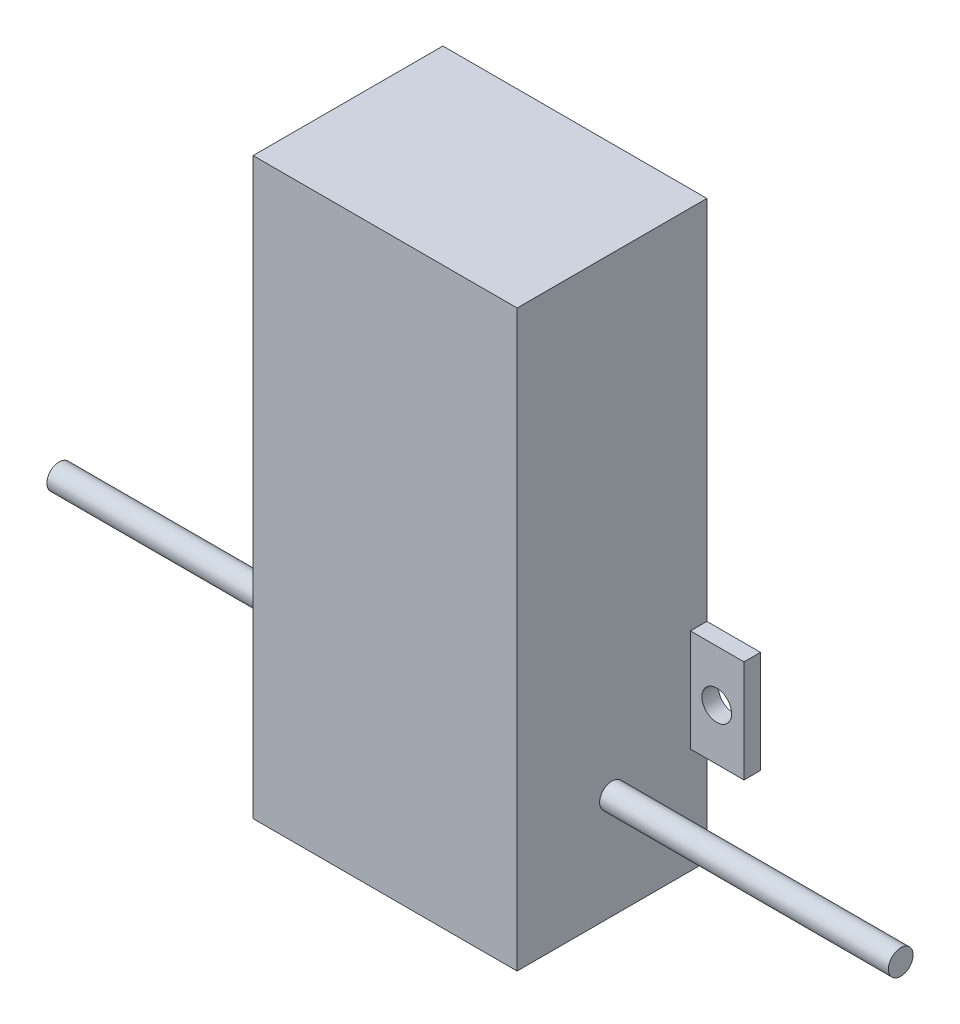
ISO-10303-21;
HEADER;
FILE_DESCRIPTION(('STEP AP214'),'2;1');
FILE_NAME('part.step','',(''),(''),'','','');
FILE_SCHEMA(('AUTOMOTIVE_DESIGN { 1 0 10303 214 1 1 1 1 }'));
ENDSEC;
DATA;
#1=APPLICATION_CONTEXT('core data for automotive mechanical design processes');
#2=APPLICATION_PROTOCOL_DEFINITION('international standard','automotive_design',2000,#1);
#3=PRODUCT_CONTEXT('',#1,'mechanical');
#4=PRODUCT('Part','Part','',(#3));
#5=PRODUCT_RELATED_PRODUCT_CATEGORY('part','',(#4));
#6=PRODUCT_DEFINITION_FORMATION('','',#4);
#7=PRODUCT_DEFINITION_CONTEXT('part definition',#1,'design');
#8=PRODUCT_DEFINITION('design','',#6,#7);
#9=PRODUCT_DEFINITION_SHAPE('','',#8);
#10=(LENGTH_UNIT() NAMED_UNIT(*) SI_UNIT(.MILLI.,.METRE.));
#11=(NAMED_UNIT(*) PLANE_ANGLE_UNIT() SI_UNIT($,.RADIAN.));
#12=(NAMED_UNIT(*) SI_UNIT($,.STERADIAN.) SOLID_ANGLE_UNIT());
#13=UNCERTAINTY_MEASURE_WITH_UNIT(LENGTH_MEASURE(1.E-05),#10,'distance_accuracy_value','');
#14=(GEOMETRIC_REPRESENTATION_CONTEXT(3) GLOBAL_UNCERTAINTY_ASSIGNED_CONTEXT((#13)) GLOBAL_UNIT_ASSIGNED_CONTEXT((#10,
#11,#12)) REPRESENTATION_CONTEXT('',''));
#15=CARTESIAN_POINT('',(0.,0.,0.));
#16=DIRECTION('',(0.,0.,1.));
#17=DIRECTION('',(1.,0.,0.));
#18=AXIS2_PLACEMENT_3D('',#15,#16,#17);
#19=CARTESIAN_POINT('',(34.2790620031797,29.2729411764706,23.));
#20=DIRECTION('',(-1.,0.,0.));
#21=DIRECTION('',(0.,0.,1.));
#22=AXIS2_PLACEMENT_3D('',#19,#20,#21);
#23=PLANE('',#22);
#24=CARTESIAN_POINT('',(34.2790620031797,-27.6270588235294,11.5));
#25=DIRECTION('',(-1.,0.,0.));
#26=DIRECTION('',(0.,0.,1.));
#27=AXIS2_PLACEMENT_3D('',#24,#25,#26);
#28=CIRCLE('',#27,1.5);
#29=CARTESIAN_POINT('',(34.2790620031797,-27.6270588235294,13.));
#30=VERTEX_POINT('',#29);
#31=EDGE_CURVE('E44',#30,#30,#28,.T.);
#32=ORIENTED_EDGE('',*,*,#31,.F.);
#33=EDGE_LOOP('',(#32));
#34=FACE_BOUND('',#33,.T.);
#35=DIRECTION('',(0.,-1.,0.));
#36=VECTOR('',#35,1.);
#37=CARTESIAN_POINT('',(34.2790620031797,-19.5220896505135,2.));
#38=LINE('',#37,#36);
#39=CARTESIAN_POINT('',(34.2790620031797,-15.1220896505135,2.));
#40=VERTEX_POINT('',#39);
#41=CARTESIAN_POINT('',(34.2790620031797,-28.4172027618297,2.));
#42=VERTEX_POINT('',#41);
#43=EDGE_CURVE('E154',#40,#42,#38,.T.);
#44=ORIENTED_EDGE('',*,*,#43,.T.);
#45=DIRECTION('',(0.,0.,1.));
#46=VECTOR('',#45,1.);
#47=CARTESIAN_POINT('',(34.2790620031797,-28.4172027618297,23.));
#48=LINE('',#47,#46);
#49=CARTESIAN_POINT('',(34.2790620031797,-28.4172027618297,0.));
#50=VERTEX_POINT('',#49);
#51=EDGE_CURVE('E11',#50,#42,#48,.T.);
#52=ORIENTED_EDGE('',*,*,#51,.F.);
#53=DIRECTION('',(0.,1.,0.));
#54=VECTOR('',#53,1.);
#55=CARTESIAN_POINT('',(34.2790620031797,29.2729411764706,0.));
#56=LINE('',#55,#54);
#57=CARTESIAN_POINT('',(34.2790620031797,-40.3270588235294,0.));
#58=VERTEX_POINT('',#57);
#59=EDGE_CURVE('E140',#58,#50,#56,.T.);
#60=ORIENTED_EDGE('',*,*,#59,.F.);
#61=DIRECTION('',(0.,0.,-1.));
#62=VECTOR('',#61,1.);
#63=CARTESIAN_POINT('',(34.2790620031797,-40.3270588235294,23.));
#64=LINE('',#63,#62);
#65=CARTESIAN_POINT('',(34.2790620031797,-40.3270588235294,23.));
#66=VERTEX_POINT('',#65);
#67=EDGE_CURVE('E171',#66,#58,#64,.T.);
#68=ORIENTED_EDGE('',*,*,#67,.F.);
#69=DIRECTION('',(0.,1.,0.));
#70=VECTOR('',#69,1.);
#71=CARTESIAN_POINT('',(34.2790620031797,29.2729411764706,23.));
#72=LINE('',#71,#70);
#73=CARTESIAN_POINT('',(34.2790620031797,29.2729411764706,23.));
#74=VERTEX_POINT('',#73);
#75=EDGE_CURVE('E168',#66,#74,#72,.T.);
#76=ORIENTED_EDGE('',*,*,#75,.T.);
#77=DIRECTION('',(0.,0.,-1.));
#78=VECTOR('',#77,1.);
#79=CARTESIAN_POINT('',(34.2790620031797,29.2729411764706,23.));
#80=LINE('',#79,#78);
#81=CARTESIAN_POINT('',(34.2790620031797,29.2729411764706,0.));
#82=VERTEX_POINT('',#81);
#83=EDGE_CURVE('E175',#74,#82,#80,.T.);
#84=ORIENTED_EDGE('',*,*,#83,.T.);
#85=CARTESIAN_POINT('',(34.2790620031797,-15.1220896505135,0.));
#86=VERTEX_POINT('',#85);
#87=EDGE_CURVE('E167',#86,#82,#56,.T.);
#88=ORIENTED_EDGE('',*,*,#87,.F.);
#89=DIRECTION('',(0.,0.,1.));
#90=VECTOR('',#89,1.);
#91=CARTESIAN_POINT('',(34.2790620031797,-15.1220896505135,0.));
#92=LINE('',#91,#90);
#93=EDGE_CURVE('E55',#86,#40,#92,.T.);
#94=ORIENTED_EDGE('',*,*,#93,.T.);
#95=EDGE_LOOP('',(#44,#52,#60,#68,#76,#84,#88,#94));
#96=FACE_BOUND('',#95,.T.);
#97=ADVANCED_FACE('F36',(#34,#96),#23,.T.);
#98=CARTESIAN_POINT('',(66.2790620031797,29.2729411764706,23.));
#99=DIRECTION('',(-1.,0.,0.));
#100=DIRECTION('',(0.,0.,1.));
#101=AXIS2_PLACEMENT_3D('',#98,#99,#100);
#102=PLANE('',#101);
#103=CARTESIAN_POINT('',(66.2790620031797,-27.6270588235294,11.5));
#104=DIRECTION('',(-1.,0.,0.));
#105=DIRECTION('',(0.,0.,1.));
#106=AXIS2_PLACEMENT_3D('',#103,#104,#105);
#107=CIRCLE('',#106,1.5);
#108=CARTESIAN_POINT('',(66.2790620031797,-27.6270588235294,13.));
#109=VERTEX_POINT('',#108);
#110=EDGE_CURVE('E229',#109,#109,#107,.F.);
#111=ORIENTED_EDGE('',*,*,#110,.F.);
#112=EDGE_LOOP('',(#111));
#113=FACE_BOUND('',#112,.T.);
#114=DIRECTION('',(0.,0.,1.));
#115=VECTOR('',#114,1.);
#116=CARTESIAN_POINT('',(66.2790620031797,-27.5220896505135,0.));
#117=LINE('',#116,#115);
#118=CARTESIAN_POINT('',(66.2790620031797,-27.5220896505135,0.));
#119=VERTEX_POINT('',#118);
#120=CARTESIAN_POINT('',(66.2790620031797,-27.5220896505135,2.));
#121=VERTEX_POINT('',#120);
#122=EDGE_CURVE('E178',#119,#121,#117,.T.);
#123=ORIENTED_EDGE('',*,*,#122,.T.);
#124=DIRECTION('',(0.,-1.,0.));
#125=VECTOR('',#124,1.);
#126=CARTESIAN_POINT('',(66.2790620031797,-19.5220896505135,2.));
#127=LINE('',#126,#125);
#128=CARTESIAN_POINT('',(66.2790620031797,-15.1220896505135,2.));
#129=VERTEX_POINT('',#128);
#130=EDGE_CURVE('E195',#129,#121,#127,.T.);
#131=ORIENTED_EDGE('',*,*,#130,.F.);
#132=DIRECTION('',(0.,0.,1.));
#133=VECTOR('',#132,1.);
#134=CARTESIAN_POINT('',(66.2790620031797,-15.1220896505135,0.));
#135=LINE('',#134,#133);
#136=CARTESIAN_POINT('',(66.2790620031797,-15.1220896505135,0.));
#137=VERTEX_POINT('',#136);
#138=EDGE_CURVE('E190',#137,#129,#135,.T.);
#139=ORIENTED_EDGE('',*,*,#138,.F.);
#140=DIRECTION('',(0.,1.,0.));
#141=VECTOR('',#140,1.);
#142=CARTESIAN_POINT('',(66.2790620031797,29.2729411764706,0.));
#143=LINE('',#142,#141);
#144=CARTESIAN_POINT('',(66.2790620031797,29.2729411764706,0.));
#145=VERTEX_POINT('',#144);
#146=EDGE_CURVE('E219',#137,#145,#143,.T.);
#147=ORIENTED_EDGE('',*,*,#146,.T.);
#148=DIRECTION('',(0.,0.,-1.));
#149=VECTOR('',#148,1.);
#150=CARTESIAN_POINT('',(66.2790620031797,29.2729411764706,23.));
#151=LINE('',#150,#149);
#152=CARTESIAN_POINT('',(66.2790620031797,29.2729411764706,23.));
#153=VERTEX_POINT('',#152);
#154=EDGE_CURVE('E217',#153,#145,#151,.T.);
#155=ORIENTED_EDGE('',*,*,#154,.F.);
#156=DIRECTION('',(0.,1.,0.));
#157=VECTOR('',#156,1.);
#158=CARTESIAN_POINT('',(66.2790620031797,29.2729411764706,23.));
#159=LINE('',#158,#157);
#160=CARTESIAN_POINT('',(66.2790620031797,-40.3270588235294,23.));
#161=VERTEX_POINT('',#160);
#162=EDGE_CURVE('E212',#161,#153,#159,.T.);
#163=ORIENTED_EDGE('',*,*,#162,.F.);
#164=DIRECTION('',(0.,0.,-1.));
#165=VECTOR('',#164,1.);
#166=CARTESIAN_POINT('',(66.2790620031797,-40.3270588235294,23.));
#167=LINE('',#166,#165);
#168=CARTESIAN_POINT('',(66.2790620031797,-40.3270588235294,0.));
#169=VERTEX_POINT('',#168);
#170=EDGE_CURVE('E226',#161,#169,#167,.T.);
#171=ORIENTED_EDGE('',*,*,#170,.T.);
#172=EDGE_CURVE('E220',#169,#119,#143,.T.);
#173=ORIENTED_EDGE('',*,*,#172,.T.);
#174=EDGE_LOOP('',(#123,#131,#139,#147,#155,#163,#171,#173));
#175=FACE_BOUND('',#174,.T.);
#176=ADVANCED_FACE('F237',(#113,#175),#102,.F.);
#177=CARTESIAN_POINT('',(0.,0.,0.));
#178=DIRECTION('',(0.,0.,1.));
#179=DIRECTION('',(1.,0.,0.));
#180=AXIS2_PLACEMENT_3D('',#177,#178,#179);
#181=PLANE('',#180);
#182=CARTESIAN_POINT('',(31.0771714081852,-21.7720896505135,0.));
#183=DIRECTION('',(0.,0.,1.));
#184=DIRECTION('',(1.,0.,0.));
#185=AXIS2_PLACEMENT_3D('',#182,#183,#184);
#186=CIRCLE('',#185,1.79810940500553);
#187=CARTESIAN_POINT('',(32.8752808131908,-21.7720896505135,0.));
#188=VERTEX_POINT('',#187);
#189=EDGE_CURVE('E339',#188,#188,#186,.T.);
#190=ORIENTED_EDGE('',*,*,#189,.T.);
#191=EDGE_LOOP('',(#190));
#192=FACE_BOUND('',#191,.T.);
#193=ORIENTED_EDGE('',*,*,#59,.T.);
#194=DIRECTION('',(-1.,0.,0.));
#195=VECTOR('',#194,1.);
#196=CARTESIAN_POINT('',(35.2790620031797,-28.4172027618297,0.));
#197=LINE('',#196,#195);
#198=CARTESIAN_POINT('',(27.7790620031797,-28.4172027618297,0.));
#199=VERTEX_POINT('',#198);
#200=EDGE_CURVE('E137',#50,#199,#197,.T.);
#201=ORIENTED_EDGE('',*,*,#200,.T.);
#202=DIRECTION('',(0.,1.,0.));
#203=VECTOR('',#202,1.);
#204=CARTESIAN_POINT('',(27.7790620031797,-19.5220896505135,0.));
#205=LINE('',#204,#203);
#206=CARTESIAN_POINT('',(27.7790620031797,-15.1220896505135,0.));
#207=VERTEX_POINT('',#206);
#208=EDGE_CURVE('E124',#199,#207,#205,.T.);
#209=ORIENTED_EDGE('',*,*,#208,.T.);
#210=DIRECTION('',(1.,0.,0.));
#211=VECTOR('',#210,1.);
#212=CARTESIAN_POINT('',(27.7790620031797,-15.1220896505135,0.));
#213=LINE('',#212,#211);
#214=EDGE_CURVE('E158',#207,#86,#213,.T.);
#215=ORIENTED_EDGE('',*,*,#214,.T.);
#216=ORIENTED_EDGE('',*,*,#87,.T.);
#217=DIRECTION('',(-1.,0.,0.));
#218=VECTOR('',#217,1.);
#219=CARTESIAN_POINT('',(34.2790620031797,29.2729411764706,0.));
#220=LINE('',#219,#218);
#221=EDGE_CURVE('E213',#145,#82,#220,.T.);
#222=ORIENTED_EDGE('',*,*,#221,.F.);
#223=ORIENTED_EDGE('',*,*,#146,.F.);
#224=DIRECTION('',(-1.,0.,0.));
#225=VECTOR('',#224,1.);
#226=CARTESIAN_POINT('',(72.7790620031797,-15.1220896505135,0.));
#227=LINE('',#226,#225);
#228=CARTESIAN_POINT('',(72.7790620031797,-15.1220896505135,0.));
#229=VERTEX_POINT('',#228);
#230=EDGE_CURVE('E204',#229,#137,#227,.T.);
#231=ORIENTED_EDGE('',*,*,#230,.F.);
#232=DIRECTION('',(0.,1.,0.));
#233=VECTOR('',#232,1.);
#234=CARTESIAN_POINT('',(72.7790620031797,-19.5220896505135,0.));
#235=LINE('',#234,#233);
#236=CARTESIAN_POINT('',(72.7790620031797,-27.5220896505135,0.));
#237=VERTEX_POINT('',#236);
#238=EDGE_CURVE('E191',#237,#229,#235,.T.);
#239=ORIENTED_EDGE('',*,*,#238,.F.);
#240=DIRECTION('',(-1.,0.,0.));
#241=VECTOR('',#240,1.);
#242=CARTESIAN_POINT('',(72.7790620031797,-27.5220896505135,0.));
#243=LINE('',#242,#241);
#244=EDGE_CURVE('E182',#237,#119,#243,.T.);
#245=ORIENTED_EDGE('',*,*,#244,.T.);
#246=ORIENTED_EDGE('',*,*,#172,.F.);
#247=DIRECTION('',(1.,0.,0.));
#248=VECTOR('',#247,1.);
#249=CARTESIAN_POINT('',(34.2790620031797,-40.3270588235294,0.));
#250=LINE('',#249,#248);
#251=EDGE_CURVE('E209',#58,#169,#250,.T.);
#252=ORIENTED_EDGE('',*,*,#251,.F.);
#253=EDGE_LOOP('',(#193,#201,#209,#215,#216,#222,#223,#231,#239,#245,#246,#252));
#254=FACE_BOUND('',#253,.T.);
#255=CARTESIAN_POINT('',(69.4772948209206,-21.3220896505135,0.));
#256=DIRECTION('',(0.,0.,1.));
#257=DIRECTION('',(1.,0.,0.));
#258=AXIS2_PLACEMENT_3D('',#255,#256,#257);
#259=CIRCLE('',#258,1.80176718225915);
#260=CARTESIAN_POINT('',(71.2790620031797,-21.3220896505135,0.));
#261=VERTEX_POINT('',#260);
#262=EDGE_CURVE('E147',#261,#261,#259,.T.);
#263=ORIENTED_EDGE('',*,*,#262,.T.);
#264=EDGE_LOOP('',(#263));
#265=FACE_BOUND('',#264,.T.);
#266=ADVANCED_FACE('F138',(#192,#254,#265),#181,.F.);
#267=CARTESIAN_POINT('',(34.2790620031797,-40.3270588235294,23.));
#268=DIRECTION('',(0.,1.,0.));
#269=DIRECTION('',(0.,0.,1.));
#270=AXIS2_PLACEMENT_3D('',#267,#268,#269);
#271=PLANE('',#270);
#272=DIRECTION('',(1.,0.,0.));
#273=VECTOR('',#272,1.);
#274=CARTESIAN_POINT('',(34.2790620031797,-40.3270588235294,23.));
#275=LINE('',#274,#273);
#276=EDGE_CURVE('E210',#66,#161,#275,.T.);
#277=ORIENTED_EDGE('',*,*,#276,.F.);
#278=ORIENTED_EDGE('',*,*,#67,.T.);
#279=ORIENTED_EDGE('',*,*,#251,.T.);
#280=ORIENTED_EDGE('',*,*,#170,.F.);
#281=EDGE_LOOP('',(#277,#278,#279,#280));
#282=FACE_BOUND('',#281,.T.);
#283=ADVANCED_FACE('F38',(#282),#271,.F.);
#284=CARTESIAN_POINT('',(34.2790620031797,29.2729411764706,23.));
#285=DIRECTION('',(0.,-1.,0.));
#286=DIRECTION('',(0.,0.,-1.));
#287=AXIS2_PLACEMENT_3D('',#284,#285,#286);
#288=PLANE('',#287);
#289=ORIENTED_EDGE('',*,*,#221,.T.);
#290=ORIENTED_EDGE('',*,*,#83,.F.);
#291=DIRECTION('',(-1.,0.,0.));
#292=VECTOR('',#291,1.);
#293=CARTESIAN_POINT('',(34.2790620031797,29.2729411764706,23.));
#294=LINE('',#293,#292);
#295=EDGE_CURVE('E215',#153,#74,#294,.T.);
#296=ORIENTED_EDGE('',*,*,#295,.F.);
#297=ORIENTED_EDGE('',*,*,#154,.T.);
#298=EDGE_LOOP('',(#289,#290,#296,#297));
#299=FACE_BOUND('',#298,.T.);
#300=ADVANCED_FACE('F248',(#299),#288,.F.);
#301=CARTESIAN_POINT('',(0.,0.,23.));
#302=DIRECTION('',(0.,0.,1.));
#303=DIRECTION('',(1.,0.,0.));
#304=AXIS2_PLACEMENT_3D('',#301,#302,#303);
#305=PLANE('',#304);
#306=ORIENTED_EDGE('',*,*,#295,.T.);
#307=ORIENTED_EDGE('',*,*,#75,.F.);
#308=ORIENTED_EDGE('',*,*,#276,.T.);
#309=ORIENTED_EDGE('',*,*,#162,.T.);
#310=EDGE_LOOP('',(#306,#307,#308,#309));
#311=FACE_BOUND('',#310,.T.);
#312=ADVANCED_FACE('F254',(#311),#305,.T.);
#313=CARTESIAN_POINT('',(101.27906200318,-27.6270588235294,11.5));
#314=DIRECTION('',(-1.,0.,0.));
#315=DIRECTION('',(0.,0.,1.));
#316=AXIS2_PLACEMENT_3D('',#313,#314,#315);
#317=CYLINDRICAL_SURFACE('',#316,1.5);
#318=CARTESIAN_POINT('',(101.27906200318,-27.6270588235294,11.5));
#319=DIRECTION('',(1.,0.,0.));
#320=DIRECTION('',(0.,0.,-1.));
#321=AXIS2_PLACEMENT_3D('',#318,#319,#320);
#322=CIRCLE('',#321,1.5);
#323=CARTESIAN_POINT('',(101.27906200318,-27.6270588235294,10.));
#324=VERTEX_POINT('',#323);
#325=EDGE_CURVE('E206',#324,#324,#322,.T.);
#326=ORIENTED_EDGE('',*,*,#325,.F.);
#327=EDGE_LOOP('',(#326));
#328=FACE_BOUND('',#327,.T.);
#329=ORIENTED_EDGE('',*,*,#110,.T.);
#330=EDGE_LOOP('',(#329));
#331=FACE_BOUND('',#330,.T.);
#332=ADVANCED_FACE('F291',(#328,#331),#317,.T.);
#333=CARTESIAN_POINT('',(101.27906200318,0.,0.));
#334=DIRECTION('',(1.,0.,0.));
#335=DIRECTION('',(0.,0.,-1.));
#336=AXIS2_PLACEMENT_3D('',#333,#334,#335);
#337=PLANE('',#336);
#338=ORIENTED_EDGE('',*,*,#325,.T.);
#339=EDGE_LOOP('',(#338));
#340=FACE_BOUND('',#339,.T.);
#341=ADVANCED_FACE('F294',(#340),#337,.T.);
#342=CARTESIAN_POINT('',(72.7790620031797,-15.1220896505135,0.));
#343=DIRECTION('',(0.,-1.,0.));
#344=DIRECTION('',(0.,0.,-1.));
#345=AXIS2_PLACEMENT_3D('',#342,#343,#344);
#346=PLANE('',#345);
#347=ORIENTED_EDGE('',*,*,#138,.T.);
#348=DIRECTION('',(-1.,0.,0.));
#349=VECTOR('',#348,1.);
#350=CARTESIAN_POINT('',(72.7790620031797,-15.1220896505135,2.));
#351=LINE('',#350,#349);
#352=CARTESIAN_POINT('',(72.7790620031797,-15.1220896505135,2.));
#353=VERTEX_POINT('',#352);
#354=EDGE_CURVE('E199',#353,#129,#351,.T.);
#355=ORIENTED_EDGE('',*,*,#354,.F.);
#356=DIRECTION('',(0.,0.,1.));
#357=VECTOR('',#356,1.);
#358=CARTESIAN_POINT('',(72.7790620031797,-15.1220896505135,0.));
#359=LINE('',#358,#357);
#360=EDGE_CURVE('E194',#229,#353,#359,.T.);
#361=ORIENTED_EDGE('',*,*,#360,.F.);
#362=ORIENTED_EDGE('',*,*,#230,.T.);
#363=EDGE_LOOP('',(#347,#355,#361,#362));
#364=FACE_BOUND('',#363,.T.);
#365=ADVANCED_FACE('F263',(#364),#346,.F.);
#366=CARTESIAN_POINT('',(72.7790620031797,-19.5220896505135,2.));
#367=DIRECTION('',(0.,0.,-1.));
#368=DIRECTION('',(-1.,0.,0.));
#369=AXIS2_PLACEMENT_3D('',#366,#367,#368);
#370=PLANE('',#369);
#371=CARTESIAN_POINT('',(69.4772948209206,-21.3220896505135,2.));
#372=DIRECTION('',(0.,0.,1.));
#373=DIRECTION('',(1.,0.,0.));
#374=AXIS2_PLACEMENT_3D('',#371,#372,#373);
#375=CIRCLE('',#374,1.80176718225915);
#376=CARTESIAN_POINT('',(71.2790620031797,-21.3220896505135,2.));
#377=VERTEX_POINT('',#376);
#378=EDGE_CURVE('E150',#377,#377,#375,.T.);
#379=ORIENTED_EDGE('',*,*,#378,.F.);
#380=EDGE_LOOP('',(#379));
#381=FACE_BOUND('',#380,.T.);
#382=ORIENTED_EDGE('',*,*,#130,.T.);
#383=DIRECTION('',(-1.,0.,0.));
#384=VECTOR('',#383,1.);
#385=CARTESIAN_POINT('',(72.7790620031797,-27.5220896505135,2.));
#386=LINE('',#385,#384);
#387=CARTESIAN_POINT('',(72.7790620031797,-27.5220896505135,2.));
#388=VERTEX_POINT('',#387);
#389=EDGE_CURVE('E187',#388,#121,#386,.T.);
#390=ORIENTED_EDGE('',*,*,#389,.F.);
#391=DIRECTION('',(0.,-1.,0.));
#392=VECTOR('',#391,1.);
#393=CARTESIAN_POINT('',(72.7790620031797,-19.5220896505135,2.));
#394=LINE('',#393,#392);
#395=EDGE_CURVE('E197',#353,#388,#394,.T.);
#396=ORIENTED_EDGE('',*,*,#395,.F.);
#397=ORIENTED_EDGE('',*,*,#354,.T.);
#398=EDGE_LOOP('',(#382,#390,#396,#397));
#399=FACE_BOUND('',#398,.T.);
#400=ADVANCED_FACE('F301',(#381,#399),#370,.F.);
#401=CARTESIAN_POINT('',(72.7790620031797,0.,0.));
#402=DIRECTION('',(1.,0.,0.));
#403=DIRECTION('',(0.,0.,-1.));
#404=AXIS2_PLACEMENT_3D('',#401,#402,#403);
#405=PLANE('',#404);
#406=ORIENTED_EDGE('',*,*,#238,.T.);
#407=ORIENTED_EDGE('',*,*,#360,.T.);
#408=ORIENTED_EDGE('',*,*,#395,.T.);
#409=DIRECTION('',(0.,0.,1.));
#410=VECTOR('',#409,1.);
#411=CARTESIAN_POINT('',(72.7790620031797,-27.5220896505135,0.));
#412=LINE('',#411,#410);
#413=EDGE_CURVE('E179',#237,#388,#412,.T.);
#414=ORIENTED_EDGE('',*,*,#413,.F.);
#415=EDGE_LOOP('',(#406,#407,#408,#414));
#416=FACE_BOUND('',#415,.T.);
#417=ADVANCED_FACE('F268',(#416),#405,.T.);
#418=CARTESIAN_POINT('',(72.7790620031797,-27.5220896505135,0.));
#419=DIRECTION('',(0.,-1.,0.));
#420=DIRECTION('',(0.,0.,-1.));
#421=AXIS2_PLACEMENT_3D('',#418,#419,#420);
#422=PLANE('',#421);
#423=ORIENTED_EDGE('',*,*,#122,.F.);
#424=ORIENTED_EDGE('',*,*,#244,.F.);
#425=ORIENTED_EDGE('',*,*,#413,.T.);
#426=ORIENTED_EDGE('',*,*,#389,.T.);
#427=EDGE_LOOP('',(#423,#424,#425,#426));
#428=FACE_BOUND('',#427,.T.);
#429=ADVANCED_FACE('F272',(#428),#422,.T.);
#430=CARTESIAN_POINT('',(-0.720937996820312,-27.6270588235294,11.5));
#431=DIRECTION('',(1.,0.,0.));
#432=DIRECTION('',(0.,0.,-1.));
#433=AXIS2_PLACEMENT_3D('',#430,#431,#432);
#434=CYLINDRICAL_SURFACE('',#433,1.5);
#435=CARTESIAN_POINT('',(-0.720937996820312,-27.6270588235294,11.5));
#436=DIRECTION('',(1.,0.,0.));
#437=DIRECTION('',(0.,0.,-1.));
#438=AXIS2_PLACEMENT_3D('',#435,#436,#437);
#439=CIRCLE('',#438,1.5);
#440=CARTESIAN_POINT('',(-0.720937996820312,-27.6270588235294,10.));
#441=VERTEX_POINT('',#440);
#442=EDGE_CURVE('E164',#441,#441,#439,.T.);
#443=ORIENTED_EDGE('',*,*,#442,.T.);
#444=EDGE_LOOP('',(#443));
#445=FACE_BOUND('',#444,.T.);
#446=ORIENTED_EDGE('',*,*,#31,.T.);
#447=EDGE_LOOP('',(#446));
#448=FACE_BOUND('',#447,.T.);
#449=ADVANCED_FACE('F234',(#445,#448),#434,.T.);
#450=CARTESIAN_POINT('',(-0.720937996820312,0.,0.));
#451=DIRECTION('',(-1.,0.,0.));
#452=DIRECTION('',(0.,0.,-1.));
#453=AXIS2_PLACEMENT_3D('',#450,#451,#452);
#454=PLANE('',#453);
#455=ORIENTED_EDGE('',*,*,#442,.F.);
#456=EDGE_LOOP('',(#455));
#457=FACE_BOUND('',#456,.T.);
#458=ADVANCED_FACE('F311',(#457),#454,.T.);
#459=CARTESIAN_POINT('',(27.7790620031797,-19.5220896505135,2.));
#460=DIRECTION('',(0.,0.,1.));
#461=DIRECTION('',(1.,0.,0.));
#462=AXIS2_PLACEMENT_3D('',#459,#460,#461);
#463=PLANE('',#462);
#464=CARTESIAN_POINT('',(31.0771714081852,-21.7720896505135,2.));
#465=DIRECTION('',(0.,0.,1.));
#466=DIRECTION('',(1.,0.,0.));
#467=AXIS2_PLACEMENT_3D('',#464,#465,#466);
#468=CIRCLE('',#467,1.79810940500553);
#469=CARTESIAN_POINT('',(32.8752808131908,-21.7720896505135,2.));
#470=VERTEX_POINT('',#469);
#471=EDGE_CURVE('E337',#470,#470,#468,.T.);
#472=ORIENTED_EDGE('',*,*,#471,.F.);
#473=EDGE_LOOP('',(#472));
#474=FACE_BOUND('',#473,.T.);
#475=DIRECTION('',(-1.,0.,0.));
#476=VECTOR('',#475,1.);
#477=CARTESIAN_POINT('',(35.2790620031797,-28.4172027618297,2.));
#478=LINE('',#477,#476);
#479=CARTESIAN_POINT('',(27.7790620031797,-28.4172027618297,2.));
#480=VERTEX_POINT('',#479);
#481=EDGE_CURVE('E142',#42,#480,#478,.T.);
#482=ORIENTED_EDGE('',*,*,#481,.F.);
#483=ORIENTED_EDGE('',*,*,#43,.F.);
#484=DIRECTION('',(1.,0.,0.));
#485=VECTOR('',#484,1.);
#486=CARTESIAN_POINT('',(27.7790620031797,-15.1220896505135,2.));
#487=LINE('',#486,#485);
#488=CARTESIAN_POINT('',(27.7790620031797,-15.1220896505135,2.));
#489=VERTEX_POINT('',#488);
#490=EDGE_CURVE('E162',#489,#40,#487,.T.);
#491=ORIENTED_EDGE('',*,*,#490,.F.);
#492=DIRECTION('',(0.,-1.,0.));
#493=VECTOR('',#492,1.);
#494=CARTESIAN_POINT('',(27.7790620031797,-19.5220896505135,2.));
#495=LINE('',#494,#493);
#496=EDGE_CURVE('E134',#489,#480,#495,.T.);
#497=ORIENTED_EDGE('',*,*,#496,.T.);
#498=EDGE_LOOP('',(#482,#483,#491,#497));
#499=FACE_BOUND('',#498,.T.);
#500=ADVANCED_FACE('F241',(#474,#499),#463,.T.);
#501=CARTESIAN_POINT('',(27.7790620031797,-15.1220896505135,0.));
#502=DIRECTION('',(0.,1.,0.));
#503=DIRECTION('',(0.,0.,1.));
#504=AXIS2_PLACEMENT_3D('',#501,#502,#503);
#505=PLANE('',#504);
#506=ORIENTED_EDGE('',*,*,#93,.F.);
#507=ORIENTED_EDGE('',*,*,#214,.F.);
#508=DIRECTION('',(0.,0.,1.));
#509=VECTOR('',#508,1.);
#510=CARTESIAN_POINT('',(27.7790620031797,-15.1220896505135,0.));
#511=LINE('',#510,#509);
#512=EDGE_CURVE('E131',#207,#489,#511,.T.);
#513=ORIENTED_EDGE('',*,*,#512,.T.);
#514=ORIENTED_EDGE('',*,*,#490,.T.);
#515=EDGE_LOOP('',(#506,#507,#513,#514));
#516=FACE_BOUND('',#515,.T.);
#517=ADVANCED_FACE('F243',(#516),#505,.T.);
#518=CARTESIAN_POINT('',(27.7790620031797,0.,0.));
#519=DIRECTION('',(-1.,0.,0.));
#520=DIRECTION('',(0.,0.,-1.));
#521=AXIS2_PLACEMENT_3D('',#518,#519,#520);
#522=PLANE('',#521);
#523=ORIENTED_EDGE('',*,*,#208,.F.);
#524=DIRECTION('',(0.,0.,1.));
#525=VECTOR('',#524,1.);
#526=CARTESIAN_POINT('',(27.7790620031797,-28.4172027618297,0.));
#527=LINE('',#526,#525);
#528=EDGE_CURVE('E129',#199,#480,#527,.T.);
#529=ORIENTED_EDGE('',*,*,#528,.T.);
#530=ORIENTED_EDGE('',*,*,#496,.F.);
#531=ORIENTED_EDGE('',*,*,#512,.F.);
#532=EDGE_LOOP('',(#523,#529,#530,#531));
#533=FACE_BOUND('',#532,.T.);
#534=ADVANCED_FACE('F126',(#533),#522,.T.);
#535=CARTESIAN_POINT('',(35.2790620031797,-28.4172027618297,0.));
#536=DIRECTION('',(0.,-1.,0.));
#537=DIRECTION('',(0.,0.,-1.));
#538=AXIS2_PLACEMENT_3D('',#535,#536,#537);
#539=PLANE('',#538);
#540=ORIENTED_EDGE('',*,*,#200,.F.);
#541=ORIENTED_EDGE('',*,*,#51,.T.);
#542=ORIENTED_EDGE('',*,*,#481,.T.);
#543=ORIENTED_EDGE('',*,*,#528,.F.);
#544=EDGE_LOOP('',(#540,#541,#542,#543));
#545=FACE_BOUND('',#544,.T.);
#546=ADVANCED_FACE('F145',(#545),#539,.T.);
#547=CARTESIAN_POINT('',(69.4772948209206,-21.3220896505135,-4.));
#548=DIRECTION('',(0.,0.,1.));
#549=DIRECTION('',(1.,0.,0.));
#550=AXIS2_PLACEMENT_3D('',#547,#548,#549);
#551=CYLINDRICAL_SURFACE('',#550,1.80176718225915);
#552=ORIENTED_EDGE('',*,*,#378,.T.);
#553=EDGE_LOOP('',(#552));
#554=FACE_BOUND('',#553,.T.);
#555=ORIENTED_EDGE('',*,*,#262,.F.);
#556=EDGE_LOOP('',(#555));
#557=FACE_BOUND('',#556,.T.);
#558=ADVANCED_FACE('F325',(#554,#557),#551,.F.);
#559=CARTESIAN_POINT('',(31.0771714081852,-21.7720896505135,-4.));
#560=DIRECTION('',(0.,0.,1.));
#561=DIRECTION('',(1.,0.,0.));
#562=AXIS2_PLACEMENT_3D('',#559,#560,#561);
#563=CYLINDRICAL_SURFACE('',#562,1.79810940500553);
#564=ORIENTED_EDGE('',*,*,#471,.T.);
#565=EDGE_LOOP('',(#564));
#566=FACE_BOUND('',#565,.T.);
#567=ORIENTED_EDGE('',*,*,#189,.F.);
#568=EDGE_LOOP('',(#567));
#569=FACE_BOUND('',#568,.T.);
#570=ADVANCED_FACE('F328',(#566,#569),#563,.F.);
#571=CLOSED_SHELL('',(#97,#176,#266,#283,#300,#312,#332,#341,#365,#400,#417,#429,#449,#458,#500,
#517,#534,#546,#558,#570));
#572=MANIFOLD_SOLID_BREP('B2',#571);
#573=ADVANCED_BREP_SHAPE_REPRESENTATION('',(#18,#572),#14);
#574=SHAPE_DEFINITION_REPRESENTATION(#9,#573);
ENDSEC;
END-ISO-10303-21;
